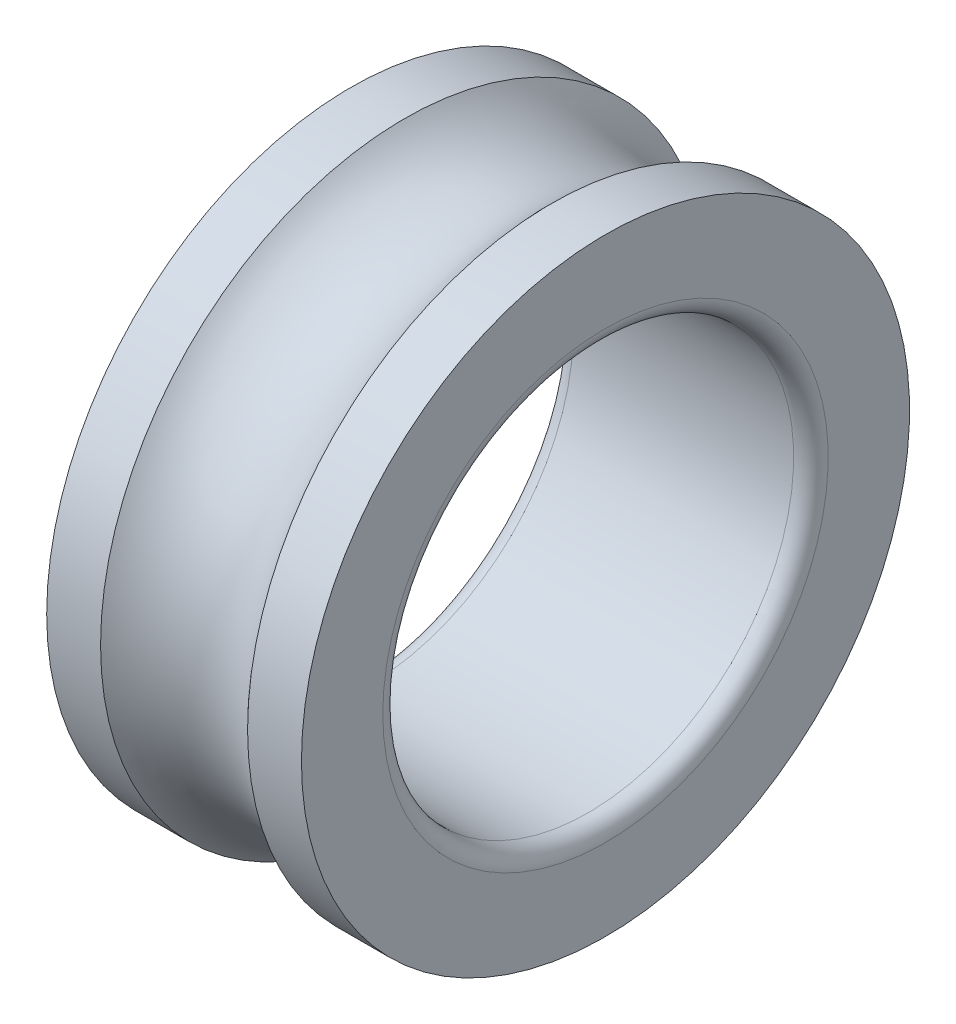
ISO-10303-21;
HEADER;
FILE_DESCRIPTION(('STEP AP214'),'2;1');
FILE_NAME('part.step','',(''),(''),'','','');
FILE_SCHEMA(('AUTOMOTIVE_DESIGN { 1 0 10303 214 1 1 1 1 }'));
ENDSEC;
DATA;
#1=APPLICATION_CONTEXT('core data for automotive mechanical design processes');
#2=APPLICATION_PROTOCOL_DEFINITION('international standard','automotive_design',2000,#1);
#3=PRODUCT_CONTEXT('',#1,'mechanical');
#4=PRODUCT('Part','Part','',(#3));
#5=PRODUCT_RELATED_PRODUCT_CATEGORY('part','',(#4));
#6=PRODUCT_DEFINITION_FORMATION('','',#4);
#7=PRODUCT_DEFINITION_CONTEXT('part definition',#1,'design');
#8=PRODUCT_DEFINITION('design','',#6,#7);
#9=PRODUCT_DEFINITION_SHAPE('','',#8);
#10=(LENGTH_UNIT() NAMED_UNIT(*) SI_UNIT(.MILLI.,.METRE.));
#11=(NAMED_UNIT(*) PLANE_ANGLE_UNIT() SI_UNIT($,.RADIAN.));
#12=(NAMED_UNIT(*) SI_UNIT($,.STERADIAN.) SOLID_ANGLE_UNIT());
#13=UNCERTAINTY_MEASURE_WITH_UNIT(LENGTH_MEASURE(1.E-05),#10,'distance_accuracy_value','');
#14=(GEOMETRIC_REPRESENTATION_CONTEXT(3) GLOBAL_UNCERTAINTY_ASSIGNED_CONTEXT((#13)) GLOBAL_UNIT_ASSIGNED_CONTEXT((#10,
#11,#12)) REPRESENTATION_CONTEXT('',''));
#15=CARTESIAN_POINT('',(0.,0.,0.));
#16=DIRECTION('',(0.,0.,1.));
#17=DIRECTION('',(1.,0.,0.));
#18=AXIS2_PLACEMENT_3D('',#15,#16,#17);
#19=CARTESIAN_POINT('',(-2.93684210526316,0.,0.));
#20=DIRECTION('',(-1.,0.,0.));
#21=DIRECTION('',(0.,0.,1.));
#22=AXIS2_PLACEMENT_3D('',#19,#20,#21);
#23=CYLINDRICAL_SURFACE('',#22,4.44);
#24=CARTESIAN_POINT('',(1.0733126291999,0.,0.));
#25=DIRECTION('',(-1.,0.,0.));
#26=DIRECTION('',(0.,0.,1.));
#27=AXIS2_PLACEMENT_3D('',#24,#25,#26);
#28=CIRCLE('',#27,4.44);
#29=CARTESIAN_POINT('',(1.0733126291999,0.,4.44));
#30=VERTEX_POINT('',#29);
#31=EDGE_CURVE('E10',#30,#30,#28,.T.);
#32=ORIENTED_EDGE('',*,*,#31,.F.);
#33=EDGE_LOOP('',(#32));
#34=FACE_BOUND('',#33,.T.);
#35=CARTESIAN_POINT('',(1.86,0.,0.));
#36=DIRECTION('',(-1.,0.,0.));
#37=DIRECTION('',(0.,0.,1.));
#38=AXIS2_PLACEMENT_3D('',#35,#36,#37);
#39=CIRCLE('',#38,4.44);
#40=CARTESIAN_POINT('',(1.86,0.,4.44));
#41=VERTEX_POINT('',#40);
#42=EDGE_CURVE('E68',#41,#41,#39,.T.);
#43=ORIENTED_EDGE('',*,*,#42,.T.);
#44=EDGE_LOOP('',(#43));
#45=FACE_BOUND('',#44,.T.);
#46=ADVANCED_FACE('F40',(#34,#45),#23,.T.);
#47=CARTESIAN_POINT('',(0.,0.,0.));
#48=DIRECTION('',(-1.,0.,0.));
#49=DIRECTION('',(0.,0.,1.));
#50=AXIS2_PLACEMENT_3D('',#47,#48,#49);
#51=TOROIDAL_SURFACE('',#50,5.4,1.44);
#52=CARTESIAN_POINT('',(-1.0733126291999,0.,0.));
#53=DIRECTION('',(-1.,0.,0.));
#54=DIRECTION('',(0.,0.,1.));
#55=AXIS2_PLACEMENT_3D('',#52,#53,#54);
#56=CIRCLE('',#55,4.44);
#57=CARTESIAN_POINT('',(-1.0733126291999,0.,4.44));
#58=VERTEX_POINT('',#57);
#59=EDGE_CURVE('E46',#58,#58,#56,.T.);
#60=ORIENTED_EDGE('',*,*,#59,.F.);
#61=EDGE_LOOP('',(#60));
#62=FACE_BOUND('',#61,.T.);
#63=ORIENTED_EDGE('',*,*,#31,.T.);
#64=EDGE_LOOP('',(#63));
#65=FACE_BOUND('',#64,.T.);
#66=ADVANCED_FACE('F105',(#62,#65),#51,.F.);
#67=CARTESIAN_POINT('',(-2.93684210526316,0.,0.));
#68=DIRECTION('',(-1.,0.,0.));
#69=DIRECTION('',(0.,0.,1.));
#70=AXIS2_PLACEMENT_3D('',#67,#68,#69);
#71=CYLINDRICAL_SURFACE('',#70,4.44);
#72=CARTESIAN_POINT('',(-1.86,0.,0.));
#73=DIRECTION('',(-1.,0.,0.));
#74=DIRECTION('',(0.,0.,1.));
#75=AXIS2_PLACEMENT_3D('',#72,#73,#74);
#76=CIRCLE('',#75,4.44);
#77=CARTESIAN_POINT('',(-1.86,0.,4.44));
#78=VERTEX_POINT('',#77);
#79=EDGE_CURVE('E50',#78,#78,#76,.T.);
#80=ORIENTED_EDGE('',*,*,#79,.F.);
#81=EDGE_LOOP('',(#80));
#82=FACE_BOUND('',#81,.T.);
#83=ORIENTED_EDGE('',*,*,#59,.T.);
#84=EDGE_LOOP('',(#83));
#85=FACE_BOUND('',#84,.T.);
#86=ADVANCED_FACE('F100',(#82,#85),#71,.T.);
#87=CARTESIAN_POINT('',(-1.86,3.252,0.));
#88=DIRECTION('',(1.,0.,0.));
#89=DIRECTION('',(0.,0.,-1.));
#90=AXIS2_PLACEMENT_3D('',#87,#88,#89);
#91=PLANE('',#90);
#92=CARTESIAN_POINT('',(-1.86,0.,0.));
#93=DIRECTION('',(-1.,0.,0.));
#94=DIRECTION('',(0.,0.,1.));
#95=AXIS2_PLACEMENT_3D('',#92,#93,#94);
#96=CIRCLE('',#95,3.252);
#97=CARTESIAN_POINT('',(-1.86,0.,3.252));
#98=VERTEX_POINT('',#97);
#99=EDGE_CURVE('E54',#98,#98,#96,.T.);
#100=ORIENTED_EDGE('',*,*,#99,.F.);
#101=EDGE_LOOP('',(#100));
#102=FACE_BOUND('',#101,.T.);
#103=ORIENTED_EDGE('',*,*,#79,.T.);
#104=EDGE_LOOP('',(#103));
#105=FACE_BOUND('',#104,.T.);
#106=ADVANCED_FACE('F94',(#102,#105),#91,.F.);
#107=CARTESIAN_POINT('',(-1.608,0.,0.));
#108=DIRECTION('',(-1.,0.,0.));
#109=DIRECTION('',(0.,0.,1.));
#110=AXIS2_PLACEMENT_3D('',#107,#108,#109);
#111=TOROIDAL_SURFACE('',#110,3.252,0.252);
#112=CARTESIAN_POINT('',(-1.608,0.,0.));
#113=DIRECTION('',(-1.,0.,0.));
#114=DIRECTION('',(0.,0.,1.));
#115=AXIS2_PLACEMENT_3D('',#112,#113,#114);
#116=CIRCLE('',#115,3.);
#117=CARTESIAN_POINT('',(-1.608,0.,3.));
#118=VERTEX_POINT('',#117);
#119=EDGE_CURVE('E59',#118,#118,#116,.T.);
#120=ORIENTED_EDGE('',*,*,#119,.F.);
#121=EDGE_LOOP('',(#120));
#122=FACE_BOUND('',#121,.T.);
#123=ORIENTED_EDGE('',*,*,#99,.T.);
#124=EDGE_LOOP('',(#123));
#125=FACE_BOUND('',#124,.T.);
#126=ADVANCED_FACE('F88',(#122,#125),#111,.T.);
#127=CARTESIAN_POINT('',(-2.93684210526316,0.,0.));
#128=DIRECTION('',(-1.,0.,0.));
#129=DIRECTION('',(0.,0.,1.));
#130=AXIS2_PLACEMENT_3D('',#127,#128,#129);
#131=CYLINDRICAL_SURFACE('',#130,3.);
#132=CARTESIAN_POINT('',(1.608,0.,0.));
#133=DIRECTION('',(-1.,0.,0.));
#134=DIRECTION('',(0.,0.,1.));
#135=AXIS2_PLACEMENT_3D('',#132,#133,#134);
#136=CIRCLE('',#135,3.);
#137=CARTESIAN_POINT('',(1.608,0.,3.));
#138=VERTEX_POINT('',#137);
#139=EDGE_CURVE('E62',#138,#138,#136,.T.);
#140=ORIENTED_EDGE('',*,*,#139,.F.);
#141=EDGE_LOOP('',(#140));
#142=FACE_BOUND('',#141,.T.);
#143=ORIENTED_EDGE('',*,*,#119,.T.);
#144=EDGE_LOOP('',(#143));
#145=FACE_BOUND('',#144,.T.);
#146=ADVANCED_FACE('F82',(#142,#145),#131,.F.);
#147=CARTESIAN_POINT('',(1.608,0.,0.));
#148=DIRECTION('',(-1.,0.,0.));
#149=DIRECTION('',(0.,0.,1.));
#150=AXIS2_PLACEMENT_3D('',#147,#148,#149);
#151=TOROIDAL_SURFACE('',#150,3.252,0.252);
#152=CARTESIAN_POINT('',(1.86,0.,0.));
#153=DIRECTION('',(-1.,0.,0.));
#154=DIRECTION('',(0.,0.,1.));
#155=AXIS2_PLACEMENT_3D('',#152,#153,#154);
#156=CIRCLE('',#155,3.252);
#157=CARTESIAN_POINT('',(1.86,0.,3.252));
#158=VERTEX_POINT('',#157);
#159=EDGE_CURVE('E65',#158,#158,#156,.T.);
#160=ORIENTED_EDGE('',*,*,#159,.F.);
#161=EDGE_LOOP('',(#160));
#162=FACE_BOUND('',#161,.T.);
#163=ORIENTED_EDGE('',*,*,#139,.T.);
#164=EDGE_LOOP('',(#163));
#165=FACE_BOUND('',#164,.T.);
#166=ADVANCED_FACE('F76',(#162,#165),#151,.T.);
#167=CARTESIAN_POINT('',(1.86,3.252,0.));
#168=DIRECTION('',(-1.,0.,0.));
#169=DIRECTION('',(0.,0.,1.));
#170=AXIS2_PLACEMENT_3D('',#167,#168,#169);
#171=PLANE('',#170);
#172=ORIENTED_EDGE('',*,*,#42,.F.);
#173=EDGE_LOOP('',(#172));
#174=FACE_BOUND('',#173,.T.);
#175=ORIENTED_EDGE('',*,*,#159,.T.);
#176=EDGE_LOOP('',(#175));
#177=FACE_BOUND('',#176,.T.);
#178=ADVANCED_FACE('F73',(#174,#177),#171,.F.);
#179=CLOSED_SHELL('',(#46,#66,#86,#106,#126,#146,#166,#178));
#180=MANIFOLD_SOLID_BREP('B2',#179);
#181=ADVANCED_BREP_SHAPE_REPRESENTATION('',(#18,#180),#14);
#182=SHAPE_DEFINITION_REPRESENTATION(#9,#181);
ENDSEC;
END-ISO-10303-21;
